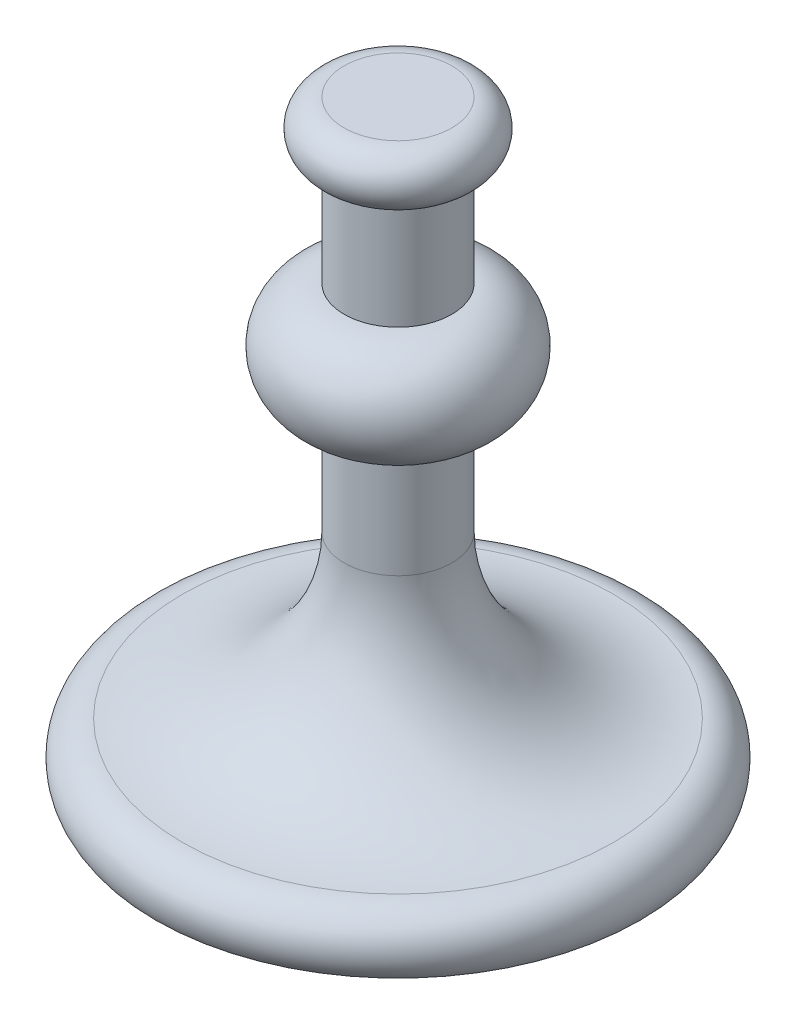
ISO-10303-21;
HEADER;
FILE_DESCRIPTION(('STEP AP214'),'2;1');
FILE_NAME('part.step','',(''),(''),'','','');
FILE_SCHEMA(('AUTOMOTIVE_DESIGN { 1 0 10303 214 1 1 1 1 }'));
ENDSEC;
DATA;
#1=APPLICATION_CONTEXT('core data for automotive mechanical design processes');
#2=APPLICATION_PROTOCOL_DEFINITION('international standard','automotive_design',2000,#1);
#3=PRODUCT_CONTEXT('',#1,'mechanical');
#4=PRODUCT('Part','Part','',(#3));
#5=PRODUCT_RELATED_PRODUCT_CATEGORY('part','',(#4));
#6=PRODUCT_DEFINITION_FORMATION('','',#4);
#7=PRODUCT_DEFINITION_CONTEXT('part definition',#1,'design');
#8=PRODUCT_DEFINITION('design','',#6,#7);
#9=PRODUCT_DEFINITION_SHAPE('','',#8);
#10=(LENGTH_UNIT() NAMED_UNIT(*) SI_UNIT(.MILLI.,.METRE.));
#11=(NAMED_UNIT(*) PLANE_ANGLE_UNIT() SI_UNIT($,.RADIAN.));
#12=(NAMED_UNIT(*) SI_UNIT($,.STERADIAN.) SOLID_ANGLE_UNIT());
#13=UNCERTAINTY_MEASURE_WITH_UNIT(LENGTH_MEASURE(1.E-05),#10,'distance_accuracy_value','');
#14=(GEOMETRIC_REPRESENTATION_CONTEXT(3) GLOBAL_UNCERTAINTY_ASSIGNED_CONTEXT((#13)) GLOBAL_UNIT_ASSIGNED_CONTEXT((#10,
#11,#12)) REPRESENTATION_CONTEXT('',''));
#15=CARTESIAN_POINT('',(0.,0.,0.));
#16=DIRECTION('',(0.,0.,1.));
#17=DIRECTION('',(1.,0.,0.));
#18=AXIS2_PLACEMENT_3D('',#15,#16,#17);
#19=CARTESIAN_POINT('',(0.,0.,0.));
#20=DIRECTION('',(0.,-1.,0.));
#21=DIRECTION('',(0.,0.,-1.));
#22=AXIS2_PLACEMENT_3D('',#19,#20,#21);
#23=PLANE('',#22);
#24=CARTESIAN_POINT('',(0.,0.,0.));
#25=DIRECTION('',(0.,-1.,0.));
#26=DIRECTION('',(0.,0.,-1.));
#27=AXIS2_PLACEMENT_3D('',#24,#25,#26);
#28=CIRCLE('',#27,90.);
#29=CARTESIAN_POINT('',(0.,0.,-90.));
#30=VERTEX_POINT('',#29);
#31=EDGE_CURVE('E62',#30,#30,#28,.T.);
#32=ORIENTED_EDGE('',*,*,#31,.T.);
#33=EDGE_LOOP('',(#32));
#34=FACE_BOUND('',#33,.T.);
#35=ADVANCED_FACE('F37',(#34),#23,.T.);
#36=CARTESIAN_POINT('',(0.,220.,0.));
#37=DIRECTION('',(0.,1.,0.));
#38=DIRECTION('',(0.,0.,1.));
#39=AXIS2_PLACEMENT_3D('',#36,#37,#38);
#40=PLANE('',#39);
#41=CARTESIAN_POINT('',(0.,220.,0.));
#42=DIRECTION('',(0.,-1.,0.));
#43=DIRECTION('',(0.,0.,-1.));
#44=AXIS2_PLACEMENT_3D('',#41,#42,#43);
#45=CIRCLE('',#44,20.);
#46=CARTESIAN_POINT('',(0.,220.,-20.));
#47=VERTEX_POINT('',#46);
#48=EDGE_CURVE('E10',#47,#47,#45,.T.);
#49=ORIENTED_EDGE('',*,*,#48,.F.);
#50=EDGE_LOOP('',(#49));
#51=FACE_BOUND('',#50,.T.);
#52=ADVANCED_FACE('F79',(#51),#40,.T.);
#53=CARTESIAN_POINT('',(0.,210.,0.));
#54=DIRECTION('',(0.,-1.,0.));
#55=DIRECTION('',(0.,0.,-1.));
#56=AXIS2_PLACEMENT_3D('',#53,#54,#55);
#57=TOROIDAL_SURFACE('',#56,20.,10.);
#58=ORIENTED_EDGE('',*,*,#48,.T.);
#59=EDGE_LOOP('',(#58));
#60=FACE_BOUND('',#59,.T.);
#61=CARTESIAN_POINT('',(0.,200.,0.));
#62=DIRECTION('',(0.,-1.,0.));
#63=DIRECTION('',(0.,0.,-1.));
#64=AXIS2_PLACEMENT_3D('',#61,#62,#63);
#65=CIRCLE('',#64,20.);
#66=CARTESIAN_POINT('',(0.,200.,-20.));
#67=VERTEX_POINT('',#66);
#68=EDGE_CURVE('E43',#67,#67,#65,.T.);
#69=ORIENTED_EDGE('',*,*,#68,.F.);
#70=EDGE_LOOP('',(#69));
#71=FACE_BOUND('',#70,.T.);
#72=ADVANCED_FACE('F83',(#60,#71),#57,.T.);
#73=CARTESIAN_POINT('',(0.,0.,0.));
#74=DIRECTION('',(0.,-1.,0.));
#75=DIRECTION('',(0.,0.,-1.));
#76=AXIS2_PLACEMENT_3D('',#73,#74,#75);
#77=CYLINDRICAL_SURFACE('',#76,20.);
#78=ORIENTED_EDGE('',*,*,#68,.T.);
#79=EDGE_LOOP('',(#78));
#80=FACE_BOUND('',#79,.T.);
#81=CARTESIAN_POINT('',(0.,160.,0.));
#82=DIRECTION('',(0.,-1.,0.));
#83=DIRECTION('',(0.,0.,-1.));
#84=AXIS2_PLACEMENT_3D('',#81,#82,#83);
#85=CIRCLE('',#84,20.);
#86=CARTESIAN_POINT('',(0.,160.,-20.));
#87=VERTEX_POINT('',#86);
#88=EDGE_CURVE('E47',#87,#87,#85,.T.);
#89=ORIENTED_EDGE('',*,*,#88,.F.);
#90=EDGE_LOOP('',(#89));
#91=FACE_BOUND('',#90,.T.);
#92=ADVANCED_FACE('F88',(#80,#91),#77,.T.);
#93=CARTESIAN_POINT('',(0.,140.,0.));
#94=DIRECTION('',(0.,-1.,0.));
#95=DIRECTION('',(0.,0.,-1.));
#96=AXIS2_PLACEMENT_3D('',#93,#94,#95);
#97=TOROIDAL_SURFACE('',#96,20.,20.);
#98=ORIENTED_EDGE('',*,*,#88,.T.);
#99=EDGE_LOOP('',(#98));
#100=FACE_BOUND('',#99,.T.);
#101=CARTESIAN_POINT('',(0.,120.,0.));
#102=DIRECTION('',(0.,-1.,0.));
#103=DIRECTION('',(0.,0.,-1.));
#104=AXIS2_PLACEMENT_3D('',#101,#102,#103);
#105=CIRCLE('',#104,20.);
#106=CARTESIAN_POINT('',(0.,120.,-20.));
#107=VERTEX_POINT('',#106);
#108=EDGE_CURVE('E51',#107,#107,#105,.T.);
#109=ORIENTED_EDGE('',*,*,#108,.F.);
#110=EDGE_LOOP('',(#109));
#111=FACE_BOUND('',#110,.T.);
#112=ADVANCED_FACE('F93',(#100,#111),#97,.T.);
#113=CARTESIAN_POINT('',(0.,0.,0.));
#114=DIRECTION('',(0.,-1.,0.));
#115=DIRECTION('',(0.,0.,-1.));
#116=AXIS2_PLACEMENT_3D('',#113,#114,#115);
#117=CYLINDRICAL_SURFACE('',#116,20.);
#118=ORIENTED_EDGE('',*,*,#108,.T.);
#119=EDGE_LOOP('',(#118));
#120=FACE_BOUND('',#119,.T.);
#121=CARTESIAN_POINT('',(0.,80.,0.));
#122=DIRECTION('',(0.,-1.,0.));
#123=DIRECTION('',(0.,0.,-1.));
#124=AXIS2_PLACEMENT_3D('',#121,#122,#123);
#125=CIRCLE('',#124,20.);
#126=CARTESIAN_POINT('',(0.,80.,-20.));
#127=VERTEX_POINT('',#126);
#128=EDGE_CURVE('E56',#127,#127,#125,.T.);
#129=ORIENTED_EDGE('',*,*,#128,.F.);
#130=EDGE_LOOP('',(#129));
#131=FACE_BOUND('',#130,.T.);
#132=ADVANCED_FACE('F75',(#120,#131),#117,.T.);
#133=CARTESIAN_POINT('',(0.,80.,0.));
#134=DIRECTION('',(0.,-1.,0.));
#135=DIRECTION('',(0.,0.,-1.));
#136=AXIS2_PLACEMENT_3D('',#133,#134,#135);
#137=TOROIDAL_SURFACE('',#136,80.,60.);
#138=ORIENTED_EDGE('',*,*,#128,.T.);
#139=EDGE_LOOP('',(#138));
#140=FACE_BOUND('',#139,.T.);
#141=CARTESIAN_POINT('',(0.,20.,0.));
#142=DIRECTION('',(0.,-1.,0.));
#143=DIRECTION('',(0.,0.,-1.));
#144=AXIS2_PLACEMENT_3D('',#141,#142,#143);
#145=CIRCLE('',#144,80.);
#146=CARTESIAN_POINT('',(0.,20.,-80.));
#147=VERTEX_POINT('',#146);
#148=EDGE_CURVE('E59',#147,#147,#145,.T.);
#149=ORIENTED_EDGE('',*,*,#148,.F.);
#150=EDGE_LOOP('',(#149));
#151=FACE_BOUND('',#150,.T.);
#152=ADVANCED_FACE('F69',(#140,#151),#137,.F.);
#153=CARTESIAN_POINT('',(0.,7.50000000000003,0.));
#154=DIRECTION('',(0.,-1.,0.));
#155=DIRECTION('',(0.,0.,-1.));
#156=AXIS2_PLACEMENT_3D('',#153,#154,#155);
#157=TOROIDAL_SURFACE('',#156,80.,12.5);
#158=ORIENTED_EDGE('',*,*,#148,.T.);
#159=EDGE_LOOP('',(#158));
#160=FACE_BOUND('',#159,.T.);
#161=ORIENTED_EDGE('',*,*,#31,.F.);
#162=EDGE_LOOP('',(#161));
#163=FACE_BOUND('',#162,.T.);
#164=ADVANCED_FACE('F67',(#160,#163),#157,.T.);
#165=CLOSED_SHELL('',(#35,#52,#72,#92,#112,#132,#152,#164));
#166=MANIFOLD_SOLID_BREP('B2',#165);
#167=ADVANCED_BREP_SHAPE_REPRESENTATION('',(#18,#166),#14);
#168=SHAPE_DEFINITION_REPRESENTATION(#9,#167);
ENDSEC;
END-ISO-10303-21;
